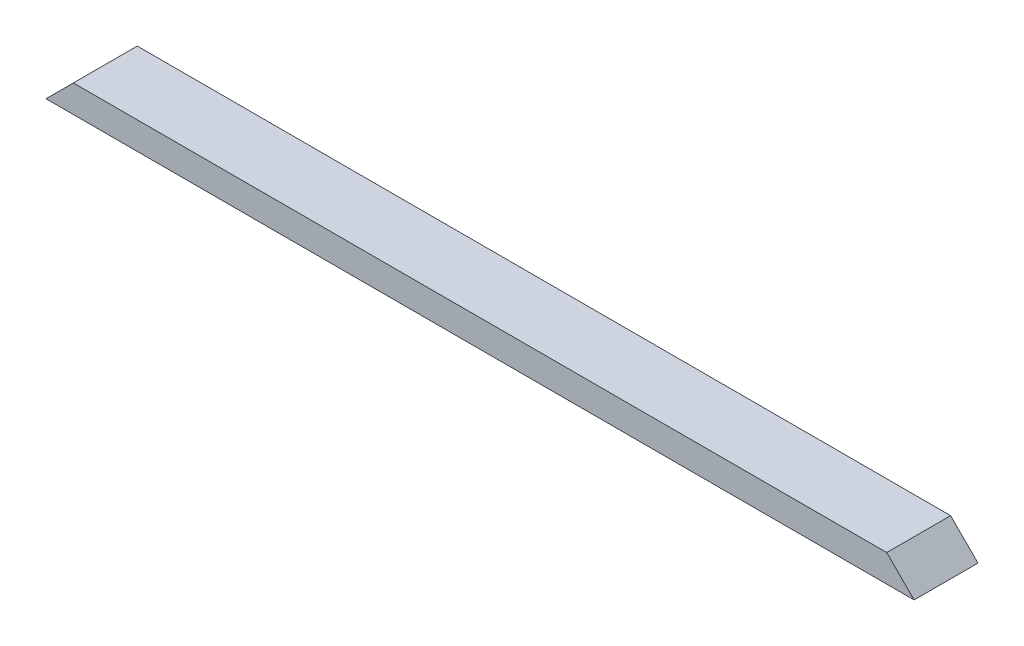
ISO-10303-21;
HEADER;
FILE_DESCRIPTION(('STEP AP214'),'2;1');
FILE_NAME('part.step','',(''),(''),'','','');
FILE_SCHEMA(('AUTOMOTIVE_DESIGN { 1 0 10303 214 1 1 1 1 }'));
ENDSEC;
DATA;
#1=APPLICATION_CONTEXT('core data for automotive mechanical design processes');
#2=APPLICATION_PROTOCOL_DEFINITION('international standard','automotive_design',2000,#1);
#3=PRODUCT_CONTEXT('',#1,'mechanical');
#4=PRODUCT('Part','Part','',(#3));
#5=PRODUCT_RELATED_PRODUCT_CATEGORY('part','',(#4));
#6=PRODUCT_DEFINITION_FORMATION('','',#4);
#7=PRODUCT_DEFINITION_CONTEXT('part definition',#1,'design');
#8=PRODUCT_DEFINITION('design','',#6,#7);
#9=PRODUCT_DEFINITION_SHAPE('','',#8);
#10=(LENGTH_UNIT() NAMED_UNIT(*) SI_UNIT(.MILLI.,.METRE.));
#11=(NAMED_UNIT(*) PLANE_ANGLE_UNIT() SI_UNIT($,.RADIAN.));
#12=(NAMED_UNIT(*) SI_UNIT($,.STERADIAN.) SOLID_ANGLE_UNIT());
#13=UNCERTAINTY_MEASURE_WITH_UNIT(LENGTH_MEASURE(1.E-05),#10,'distance_accuracy_value','');
#14=(GEOMETRIC_REPRESENTATION_CONTEXT(3) GLOBAL_UNCERTAINTY_ASSIGNED_CONTEXT((#13)) GLOBAL_UNIT_ASSIGNED_CONTEXT((#10,
#11,#12)) REPRESENTATION_CONTEXT('',''));
#15=CARTESIAN_POINT('',(0.,0.,0.));
#16=DIRECTION('',(0.,0.,1.));
#17=DIRECTION('',(1.,0.,0.));
#18=AXIS2_PLACEMENT_3D('',#15,#16,#17);
#19=CARTESIAN_POINT('',(0.,38.1,0.));
#20=DIRECTION('',(0.,0.,-1.));
#21=DIRECTION('',(-1.,0.,0.));
#22=AXIS2_PLACEMENT_3D('',#19,#20,#21);
#23=PLANE('',#22);
#24=DIRECTION('',(1.,0.,0.));
#25=VECTOR('',#24,1.);
#26=CARTESIAN_POINT('',(0.,38.1,0.));
#27=LINE('',#26,#25);
#28=CARTESIAN_POINT('',(38.1,38.1,0.));
#29=VERTEX_POINT('',#28);
#30=CARTESIAN_POINT('',(1169.9875,38.1000000000001,0.));
#31=VERTEX_POINT('',#30);
#32=EDGE_CURVE('E47',#29,#31,#27,.T.);
#33=ORIENTED_EDGE('',*,*,#32,.F.);
#34=DIRECTION('',(0.707106781186547,0.707106781186547,0.));
#35=VECTOR('',#34,1.);
#36=CARTESIAN_POINT('',(0.,0.,0.));
#37=LINE('',#36,#35);
#38=CARTESIAN_POINT('',(0.,0.,0.));
#39=VERTEX_POINT('',#38);
#40=EDGE_CURVE('E82',#39,#29,#37,.T.);
#41=ORIENTED_EDGE('',*,*,#40,.F.);
#42=DIRECTION('',(1.,0.,0.));
#43=VECTOR('',#42,1.);
#44=CARTESIAN_POINT('',(0.,0.,0.));
#45=LINE('',#44,#43);
#46=CARTESIAN_POINT('',(1208.0875,0.,0.));
#47=VERTEX_POINT('',#46);
#48=EDGE_CURVE('E87',#39,#47,#45,.T.);
#49=ORIENTED_EDGE('',*,*,#48,.T.);
#50=DIRECTION('',(0.707106781186547,-0.707106781186548,0.));
#51=VECTOR('',#50,1.);
#52=CARTESIAN_POINT('',(1169.9875,38.1000000000001,0.));
#53=LINE('',#52,#51);
#54=EDGE_CURVE('E63',#31,#47,#53,.T.);
#55=ORIENTED_EDGE('',*,*,#54,.F.);
#56=EDGE_LOOP('',(#33,#41,#49,#55));
#57=FACE_BOUND('',#56,.T.);
#58=ADVANCED_FACE('F39',(#57),#23,.F.);
#59=CARTESIAN_POINT('',(0.,38.1,-88.9));
#60=DIRECTION('',(0.,0.,1.));
#61=DIRECTION('',(1.,0.,0.));
#62=AXIS2_PLACEMENT_3D('',#59,#60,#61);
#63=PLANE('',#62);
#64=DIRECTION('',(-1.,0.,0.));
#65=VECTOR('',#64,1.);
#66=CARTESIAN_POINT('',(0.,0.,-88.9));
#67=LINE('',#66,#65);
#68=CARTESIAN_POINT('',(1208.0875,0.,-88.9));
#69=VERTEX_POINT('',#68);
#70=CARTESIAN_POINT('',(0.,0.,-88.9));
#71=VERTEX_POINT('',#70);
#72=EDGE_CURVE('E42',#69,#71,#67,.T.);
#73=ORIENTED_EDGE('',*,*,#72,.T.);
#74=DIRECTION('',(0.707106781186547,0.707106781186547,0.));
#75=VECTOR('',#74,1.);
#76=CARTESIAN_POINT('',(0.,0.,-88.9));
#77=LINE('',#76,#75);
#78=CARTESIAN_POINT('',(38.1,38.1,-88.9));
#79=VERTEX_POINT('',#78);
#80=EDGE_CURVE('E55',#71,#79,#77,.T.);
#81=ORIENTED_EDGE('',*,*,#80,.T.);
#82=DIRECTION('',(-1.,0.,0.));
#83=VECTOR('',#82,1.);
#84=CARTESIAN_POINT('',(0.,38.1,-88.9));
#85=LINE('',#84,#83);
#86=CARTESIAN_POINT('',(1169.9875,38.1000000000001,-88.9));
#87=VERTEX_POINT('',#86);
#88=EDGE_CURVE('E11',#87,#79,#85,.T.);
#89=ORIENTED_EDGE('',*,*,#88,.F.);
#90=DIRECTION('',(0.707106781186547,-0.707106781186548,0.));
#91=VECTOR('',#90,1.);
#92=CARTESIAN_POINT('',(1169.9875,38.1000000000001,-88.9));
#93=LINE('',#92,#91);
#94=EDGE_CURVE('E100',#87,#69,#93,.T.);
#95=ORIENTED_EDGE('',*,*,#94,.T.);
#96=EDGE_LOOP('',(#73,#81,#89,#95));
#97=FACE_BOUND('',#96,.T.);
#98=ADVANCED_FACE('F109',(#97),#63,.F.);
#99=CARTESIAN_POINT('',(0.,38.1,0.));
#100=DIRECTION('',(0.,-1.,0.));
#101=DIRECTION('',(0.,0.,-1.));
#102=AXIS2_PLACEMENT_3D('',#99,#100,#101);
#103=PLANE('',#102);
#104=ORIENTED_EDGE('',*,*,#88,.T.);
#105=DIRECTION('',(0.,0.,1.));
#106=VECTOR('',#105,1.);
#107=CARTESIAN_POINT('',(38.1,38.1,-88.9));
#108=LINE('',#107,#106);
#109=EDGE_CURVE('E88',#79,#29,#108,.T.);
#110=ORIENTED_EDGE('',*,*,#109,.T.);
#111=ORIENTED_EDGE('',*,*,#32,.T.);
#112=DIRECTION('',(0.,0.,1.));
#113=VECTOR('',#112,1.);
#114=CARTESIAN_POINT('',(1169.9875,38.1000000000001,-88.9));
#115=LINE('',#114,#113);
#116=EDGE_CURVE('E103',#87,#31,#115,.T.);
#117=ORIENTED_EDGE('',*,*,#116,.F.);
#118=EDGE_LOOP('',(#104,#110,#111,#117));
#119=FACE_BOUND('',#118,.T.);
#120=ADVANCED_FACE('F112',(#119),#103,.F.);
#121=CARTESIAN_POINT('',(0.,0.,0.));
#122=DIRECTION('',(0.,-1.,0.));
#123=DIRECTION('',(0.,0.,-1.));
#124=AXIS2_PLACEMENT_3D('',#121,#122,#123);
#125=PLANE('',#124);
#126=DIRECTION('',(0.,0.,1.));
#127=VECTOR('',#126,1.);
#128=CARTESIAN_POINT('',(0.,0.,0.));
#129=LINE('',#128,#127);
#130=EDGE_CURVE('E79',#71,#39,#129,.T.);
#131=ORIENTED_EDGE('',*,*,#130,.F.);
#132=ORIENTED_EDGE('',*,*,#72,.F.);
#133=DIRECTION('',(0.,0.,-1.));
#134=VECTOR('',#133,1.);
#135=CARTESIAN_POINT('',(1208.0875,0.,0.));
#136=LINE('',#135,#134);
#137=EDGE_CURVE('E96',#47,#69,#136,.T.);
#138=ORIENTED_EDGE('',*,*,#137,.F.);
#139=ORIENTED_EDGE('',*,*,#48,.F.);
#140=EDGE_LOOP('',(#131,#132,#138,#139));
#141=FACE_BOUND('',#140,.T.);
#142=ADVANCED_FACE('F95',(#141),#125,.T.);
#143=CARTESIAN_POINT('',(1169.9875,38.1000000000001,-88.9));
#144=DIRECTION('',(-0.707106781186548,-0.707106781186547,0.));
#145=DIRECTION('',(0.707106781186547,-0.707106781186548,0.));
#146=AXIS2_PLACEMENT_3D('',#143,#144,#145);
#147=PLANE('',#146);
#148=ORIENTED_EDGE('',*,*,#54,.T.);
#149=ORIENTED_EDGE('',*,*,#137,.T.);
#150=ORIENTED_EDGE('',*,*,#94,.F.);
#151=ORIENTED_EDGE('',*,*,#116,.T.);
#152=EDGE_LOOP('',(#148,#149,#150,#151));
#153=FACE_BOUND('',#152,.T.);
#154=ADVANCED_FACE('F113',(#153),#147,.F.);
#155=CARTESIAN_POINT('',(0.,0.,-88.9));
#156=DIRECTION('',(0.707106781186547,-0.707106781186547,0.));
#157=DIRECTION('',(0.707106781186548,0.707106781186548,0.));
#158=AXIS2_PLACEMENT_3D('',#155,#156,#157);
#159=PLANE('',#158);
#160=ORIENTED_EDGE('',*,*,#40,.T.);
#161=ORIENTED_EDGE('',*,*,#109,.F.);
#162=ORIENTED_EDGE('',*,*,#80,.F.);
#163=ORIENTED_EDGE('',*,*,#130,.T.);
#164=EDGE_LOOP('',(#160,#161,#162,#163));
#165=FACE_BOUND('',#164,.T.);
#166=ADVANCED_FACE('F81',(#165),#159,.F.);
#167=CLOSED_SHELL('',(#58,#98,#120,#142,#154,#166));
#168=MANIFOLD_SOLID_BREP('B2',#167);
#169=ADVANCED_BREP_SHAPE_REPRESENTATION('',(#18,#168),#14);
#170=SHAPE_DEFINITION_REPRESENTATION(#9,#169);
ENDSEC;
END-ISO-10303-21;
